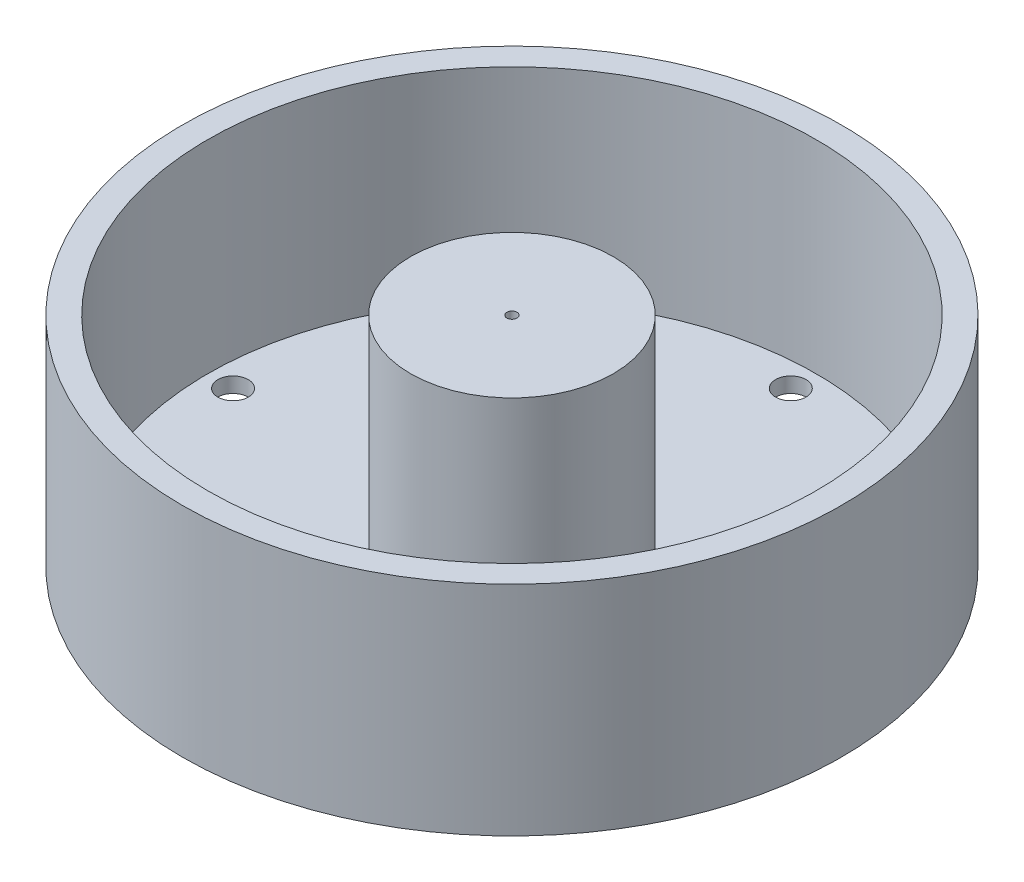
ISO-10303-21;
HEADER;
FILE_DESCRIPTION(('STEP AP214'),'2;1');
FILE_NAME('part.step','',(''),(''),'','','');
FILE_SCHEMA(('AUTOMOTIVE_DESIGN { 1 0 10303 214 1 1 1 1 }'));
ENDSEC;
DATA;
#1=APPLICATION_CONTEXT('core data for automotive mechanical design processes');
#2=APPLICATION_PROTOCOL_DEFINITION('international standard','automotive_design',2000,#1);
#3=PRODUCT_CONTEXT('',#1,'mechanical');
#4=PRODUCT('Part','Part','',(#3));
#5=PRODUCT_RELATED_PRODUCT_CATEGORY('part','',(#4));
#6=PRODUCT_DEFINITION_FORMATION('','',#4);
#7=PRODUCT_DEFINITION_CONTEXT('part definition',#1,'design');
#8=PRODUCT_DEFINITION('design','',#6,#7);
#9=PRODUCT_DEFINITION_SHAPE('','',#8);
#10=(LENGTH_UNIT() NAMED_UNIT(*) SI_UNIT(.MILLI.,.METRE.));
#11=(NAMED_UNIT(*) PLANE_ANGLE_UNIT() SI_UNIT($,.RADIAN.));
#12=(NAMED_UNIT(*) SI_UNIT($,.STERADIAN.) SOLID_ANGLE_UNIT());
#13=UNCERTAINTY_MEASURE_WITH_UNIT(LENGTH_MEASURE(1.E-05),#10,'distance_accuracy_value','');
#14=(GEOMETRIC_REPRESENTATION_CONTEXT(3) GLOBAL_UNCERTAINTY_ASSIGNED_CONTEXT((#13)) GLOBAL_UNIT_ASSIGNED_CONTEXT((#10,
#11,#12)) REPRESENTATION_CONTEXT('',''));
#15=CARTESIAN_POINT('',(0.,0.,0.));
#16=DIRECTION('',(0.,0.,1.));
#17=DIRECTION('',(1.,0.,0.));
#18=AXIS2_PLACEMENT_3D('',#15,#16,#17);
#19=CARTESIAN_POINT('',(0.,3.,0.));
#20=DIRECTION('',(0.,1.,0.));
#21=DIRECTION('',(0.,0.,1.));
#22=AXIS2_PLACEMENT_3D('',#19,#20,#21);
#23=PLANE('',#22);
#24=CARTESIAN_POINT('',(0.,3.,0.));
#25=DIRECTION('',(0.,1.,0.));
#26=DIRECTION('',(0.,0.,1.));
#27=AXIS2_PLACEMENT_3D('',#24,#25,#26);
#28=CIRCLE('',#27,20.);
#29=CARTESIAN_POINT('',(0.,3.,20.));
#30=VERTEX_POINT('',#29);
#31=EDGE_CURVE('E76',#30,#30,#28,.T.);
#32=ORIENTED_EDGE('',*,*,#31,.F.);
#33=EDGE_LOOP('',(#32));
#34=FACE_BOUND('',#33,.T.);
#35=CARTESIAN_POINT('',(0.,3.,-55.));
#36=DIRECTION('',(0.,1.,0.));
#37=DIRECTION('',(0.,0.,1.));
#38=AXIS2_PLACEMENT_3D('',#35,#36,#37);
#39=CIRCLE('',#38,3.);
#40=CARTESIAN_POINT('',(0.,3.,-52.));
#41=VERTEX_POINT('',#40);
#42=EDGE_CURVE('E43',#41,#41,#39,.T.);
#43=ORIENTED_EDGE('',*,*,#42,.F.);
#44=EDGE_LOOP('',(#43));
#45=FACE_BOUND('',#44,.T.);
#46=CARTESIAN_POINT('',(55.,3.,-5.76094420909117E-13));
#47=DIRECTION('',(0.,1.,0.));
#48=DIRECTION('',(-1.,0.,0.));
#49=AXIS2_PLACEMENT_3D('',#46,#47,#48);
#50=CIRCLE('',#49,3.);
#51=CARTESIAN_POINT('',(52.,3.,-5.44671088859529E-13));
#52=VERTEX_POINT('',#51);
#53=EDGE_CURVE('E49',#52,#52,#50,.T.);
#54=ORIENTED_EDGE('',*,*,#53,.F.);
#55=EDGE_LOOP('',(#54));
#56=FACE_BOUND('',#55,.T.);
#57=CARTESIAN_POINT('',(0.,3.,55.));
#58=DIRECTION('',(0.,1.,0.));
#59=DIRECTION('',(0.,0.,-1.));
#60=AXIS2_PLACEMENT_3D('',#57,#58,#59);
#61=CIRCLE('',#60,3.);
#62=CARTESIAN_POINT('',(0.,3.,52.));
#63=VERTEX_POINT('',#62);
#64=EDGE_CURVE('E57',#63,#63,#61,.T.);
#65=ORIENTED_EDGE('',*,*,#64,.F.);
#66=EDGE_LOOP('',(#65));
#67=FACE_BOUND('',#66,.T.);
#68=CARTESIAN_POINT('',(-55.,3.,1.92031473636372E-13));
#69=DIRECTION('',(0.,1.,0.));
#70=DIRECTION('',(1.,0.,0.));
#71=AXIS2_PLACEMENT_3D('',#68,#69,#70);
#72=CIRCLE('',#71,3.);
#73=CARTESIAN_POINT('',(-52.,3.,1.81557029619843E-13));
#74=VERTEX_POINT('',#73);
#75=EDGE_CURVE('E47',#74,#74,#72,.T.);
#76=ORIENTED_EDGE('',*,*,#75,.F.);
#77=EDGE_LOOP('',(#76));
#78=FACE_BOUND('',#77,.T.);
#79=CARTESIAN_POINT('',(0.,3.,0.));
#80=DIRECTION('',(0.,1.,0.));
#81=DIRECTION('',(0.,0.,1.));
#82=AXIS2_PLACEMENT_3D('',#79,#80,#81);
#83=CIRCLE('',#82,60.);
#84=CARTESIAN_POINT('',(0.,3.,60.));
#85=VERTEX_POINT('',#84);
#86=EDGE_CURVE('E70',#85,#85,#83,.T.);
#87=ORIENTED_EDGE('',*,*,#86,.T.);
#88=EDGE_LOOP('',(#87));
#89=FACE_BOUND('',#88,.T.);
#90=ADVANCED_FACE('F31',(#34,#45,#56,#67,#78,#89),#23,.T.);
#91=CARTESIAN_POINT('',(0.,3.,0.));
#92=DIRECTION('',(0.,-1.,0.));
#93=DIRECTION('',(0.,0.,-1.));
#94=AXIS2_PLACEMENT_3D('',#91,#92,#93);
#95=CYLINDRICAL_SURFACE('',#94,65.);
#96=CARTESIAN_POINT('',(0.,0.,0.));
#97=DIRECTION('',(0.,1.,0.));
#98=DIRECTION('',(0.,0.,1.));
#99=AXIS2_PLACEMENT_3D('',#96,#97,#98);
#100=CIRCLE('',#99,65.);
#101=CARTESIAN_POINT('',(0.,0.,65.));
#102=VERTEX_POINT('',#101);
#103=EDGE_CURVE('E10',#102,#102,#100,.T.);
#104=ORIENTED_EDGE('',*,*,#103,.T.);
#105=EDGE_LOOP('',(#104));
#106=FACE_BOUND('',#105,.T.);
#107=CARTESIAN_POINT('',(0.,43.,0.));
#108=DIRECTION('',(0.,1.,0.));
#109=DIRECTION('',(0.,0.,1.));
#110=AXIS2_PLACEMENT_3D('',#107,#108,#109);
#111=CIRCLE('',#110,65.);
#112=CARTESIAN_POINT('',(0.,43.,65.));
#113=VERTEX_POINT('',#112);
#114=EDGE_CURVE('E56',#113,#113,#111,.T.);
#115=ORIENTED_EDGE('',*,*,#114,.F.);
#116=EDGE_LOOP('',(#115));
#117=FACE_BOUND('',#116,.T.);
#118=ADVANCED_FACE('F33',(#106,#117),#95,.T.);
#119=CARTESIAN_POINT('',(0.,0.,0.));
#120=DIRECTION('',(0.,1.,0.));
#121=DIRECTION('',(0.,0.,1.));
#122=AXIS2_PLACEMENT_3D('',#119,#120,#121);
#123=PLANE('',#122);
#124=CARTESIAN_POINT('',(0.,0.,0.));
#125=DIRECTION('',(0.,-1.,0.));
#126=DIRECTION('',(0.,0.,-1.));
#127=AXIS2_PLACEMENT_3D('',#124,#125,#126);
#128=CIRCLE('',#127,10.);
#129=CARTESIAN_POINT('',(0.,0.,-10.));
#130=VERTEX_POINT('',#129);
#131=EDGE_CURVE('E82',#130,#130,#128,.T.);
#132=ORIENTED_EDGE('',*,*,#131,.F.);
#133=EDGE_LOOP('',(#132));
#134=FACE_BOUND('',#133,.T.);
#135=CARTESIAN_POINT('',(-55.,0.,1.92031473636372E-13));
#136=DIRECTION('',(0.,1.,0.));
#137=DIRECTION('',(1.,0.,0.));
#138=AXIS2_PLACEMENT_3D('',#135,#136,#137);
#139=CIRCLE('',#138,3.);
#140=CARTESIAN_POINT('',(-52.,0.,1.81557029619843E-13));
#141=VERTEX_POINT('',#140);
#142=EDGE_CURVE('E60',#141,#141,#139,.T.);
#143=ORIENTED_EDGE('',*,*,#142,.T.);
#144=EDGE_LOOP('',(#143));
#145=FACE_BOUND('',#144,.T.);
#146=CARTESIAN_POINT('',(0.,0.,55.));
#147=DIRECTION('',(0.,1.,0.));
#148=DIRECTION('',(0.,0.,-1.));
#149=AXIS2_PLACEMENT_3D('',#146,#147,#148);
#150=CIRCLE('',#149,3.);
#151=CARTESIAN_POINT('',(0.,0.,52.));
#152=VERTEX_POINT('',#151);
#153=EDGE_CURVE('E52',#152,#152,#150,.T.);
#154=ORIENTED_EDGE('',*,*,#153,.T.);
#155=EDGE_LOOP('',(#154));
#156=FACE_BOUND('',#155,.T.);
#157=CARTESIAN_POINT('',(55.,0.,-5.76094420909117E-13));
#158=DIRECTION('',(0.,1.,0.));
#159=DIRECTION('',(-1.,0.,0.));
#160=AXIS2_PLACEMENT_3D('',#157,#158,#159);
#161=CIRCLE('',#160,3.);
#162=CARTESIAN_POINT('',(52.,0.,-5.44671088859529E-13));
#163=VERTEX_POINT('',#162);
#164=EDGE_CURVE('E53',#163,#163,#161,.T.);
#165=ORIENTED_EDGE('',*,*,#164,.T.);
#166=EDGE_LOOP('',(#165));
#167=FACE_BOUND('',#166,.T.);
#168=CARTESIAN_POINT('',(0.,0.,-55.));
#169=DIRECTION('',(0.,1.,0.));
#170=DIRECTION('',(0.,0.,1.));
#171=AXIS2_PLACEMENT_3D('',#168,#169,#170);
#172=CIRCLE('',#171,3.);
#173=CARTESIAN_POINT('',(0.,0.,-52.));
#174=VERTEX_POINT('',#173);
#175=EDGE_CURVE('E39',#174,#174,#172,.T.);
#176=ORIENTED_EDGE('',*,*,#175,.T.);
#177=EDGE_LOOP('',(#176));
#178=FACE_BOUND('',#177,.T.);
#179=ORIENTED_EDGE('',*,*,#103,.F.);
#180=EDGE_LOOP('',(#179));
#181=FACE_BOUND('',#180,.T.);
#182=ADVANCED_FACE('F109',(#134,#145,#156,#167,#178,#181),#123,.F.);
#183=CARTESIAN_POINT('',(0.,0.,-55.));
#184=DIRECTION('',(0.,1.,0.));
#185=DIRECTION('',(0.,0.,1.));
#186=AXIS2_PLACEMENT_3D('',#183,#184,#185);
#187=CYLINDRICAL_SURFACE('',#186,3.);
#188=ORIENTED_EDGE('',*,*,#175,.F.);
#189=EDGE_LOOP('',(#188));
#190=FACE_BOUND('',#189,.T.);
#191=ORIENTED_EDGE('',*,*,#42,.T.);
#192=EDGE_LOOP('',(#191));
#193=FACE_BOUND('',#192,.T.);
#194=ADVANCED_FACE('F112',(#190,#193),#187,.F.);
#195=CARTESIAN_POINT('',(55.,0.,-5.76094420909117E-13));
#196=DIRECTION('',(0.,1.,0.));
#197=DIRECTION('',(-1.,0.,0.));
#198=AXIS2_PLACEMENT_3D('',#195,#196,#197);
#199=CYLINDRICAL_SURFACE('',#198,3.);
#200=ORIENTED_EDGE('',*,*,#164,.F.);
#201=EDGE_LOOP('',(#200));
#202=FACE_BOUND('',#201,.T.);
#203=ORIENTED_EDGE('',*,*,#53,.T.);
#204=EDGE_LOOP('',(#203));
#205=FACE_BOUND('',#204,.T.);
#206=ADVANCED_FACE('F124',(#202,#205),#199,.F.);
#207=CARTESIAN_POINT('',(0.,0.,55.));
#208=DIRECTION('',(0.,1.,0.));
#209=DIRECTION('',(0.,0.,-1.));
#210=AXIS2_PLACEMENT_3D('',#207,#208,#209);
#211=CYLINDRICAL_SURFACE('',#210,3.);
#212=ORIENTED_EDGE('',*,*,#153,.F.);
#213=EDGE_LOOP('',(#212));
#214=FACE_BOUND('',#213,.T.);
#215=ORIENTED_EDGE('',*,*,#64,.T.);
#216=EDGE_LOOP('',(#215));
#217=FACE_BOUND('',#216,.T.);
#218=ADVANCED_FACE('F159',(#214,#217),#211,.F.);
#219=CARTESIAN_POINT('',(-55.,0.,1.92031473636372E-13));
#220=DIRECTION('',(0.,1.,0.));
#221=DIRECTION('',(1.,0.,0.));
#222=AXIS2_PLACEMENT_3D('',#219,#220,#221);
#223=CYLINDRICAL_SURFACE('',#222,3.);
#224=ORIENTED_EDGE('',*,*,#142,.F.);
#225=EDGE_LOOP('',(#224));
#226=FACE_BOUND('',#225,.T.);
#227=ORIENTED_EDGE('',*,*,#75,.T.);
#228=EDGE_LOOP('',(#227));
#229=FACE_BOUND('',#228,.T.);
#230=ADVANCED_FACE('F152',(#226,#229),#223,.F.);
#231=CARTESIAN_POINT('',(0.,43.,0.));
#232=DIRECTION('',(0.,1.,0.));
#233=DIRECTION('',(0.,0.,1.));
#234=AXIS2_PLACEMENT_3D('',#231,#232,#233);
#235=PLANE('',#234);
#236=ORIENTED_EDGE('',*,*,#114,.T.);
#237=EDGE_LOOP('',(#236));
#238=FACE_BOUND('',#237,.T.);
#239=CARTESIAN_POINT('',(0.,43.,0.));
#240=DIRECTION('',(0.,1.,0.));
#241=DIRECTION('',(0.,0.,1.));
#242=AXIS2_PLACEMENT_3D('',#239,#240,#241);
#243=CIRCLE('',#242,60.);
#244=CARTESIAN_POINT('',(0.,43.,60.));
#245=VERTEX_POINT('',#244);
#246=EDGE_CURVE('E69',#245,#245,#243,.T.);
#247=ORIENTED_EDGE('',*,*,#246,.F.);
#248=EDGE_LOOP('',(#247));
#249=FACE_BOUND('',#248,.T.);
#250=ADVANCED_FACE('F143',(#238,#249),#235,.T.);
#251=CARTESIAN_POINT('',(0.,43.,0.));
#252=DIRECTION('',(0.,-1.,0.));
#253=DIRECTION('',(0.,0.,-1.));
#254=AXIS2_PLACEMENT_3D('',#251,#252,#253);
#255=CYLINDRICAL_SURFACE('',#254,60.);
#256=ORIENTED_EDGE('',*,*,#246,.T.);
#257=EDGE_LOOP('',(#256));
#258=FACE_BOUND('',#257,.T.);
#259=ORIENTED_EDGE('',*,*,#86,.F.);
#260=EDGE_LOOP('',(#259));
#261=FACE_BOUND('',#260,.T.);
#262=ADVANCED_FACE('F140',(#258,#261),#255,.F.);
#263=CARTESIAN_POINT('',(0.,43.,0.));
#264=DIRECTION('',(0.,-1.,0.));
#265=DIRECTION('',(0.,0.,-1.));
#266=AXIS2_PLACEMENT_3D('',#263,#264,#265);
#267=CYLINDRICAL_SURFACE('',#266,20.);
#268=CARTESIAN_POINT('',(0.,43.,0.));
#269=DIRECTION('',(0.,1.,0.));
#270=DIRECTION('',(0.,0.,1.));
#271=AXIS2_PLACEMENT_3D('',#268,#269,#270);
#272=CIRCLE('',#271,20.);
#273=CARTESIAN_POINT('',(0.,43.,20.));
#274=VERTEX_POINT('',#273);
#275=EDGE_CURVE('E73',#274,#274,#272,.T.);
#276=ORIENTED_EDGE('',*,*,#275,.F.);
#277=EDGE_LOOP('',(#276));
#278=FACE_BOUND('',#277,.T.);
#279=ORIENTED_EDGE('',*,*,#31,.T.);
#280=EDGE_LOOP('',(#279));
#281=FACE_BOUND('',#280,.T.);
#282=ADVANCED_FACE('F142',(#278,#281),#267,.T.);
#283=CARTESIAN_POINT('',(0.,43.,0.));
#284=DIRECTION('',(0.,1.,0.));
#285=DIRECTION('',(0.,0.,1.));
#286=AXIS2_PLACEMENT_3D('',#283,#284,#285);
#287=PLANE('',#286);
#288=CARTESIAN_POINT('',(0.,43.,0.));
#289=DIRECTION('',(0.,1.,0.));
#290=DIRECTION('',(0.,0.,1.));
#291=AXIS2_PLACEMENT_3D('',#288,#289,#290);
#292=CIRCLE('',#291,1.);
#293=CARTESIAN_POINT('',(0.,43.,1.));
#294=VERTEX_POINT('',#293);
#295=EDGE_CURVE('E87',#294,#294,#292,.T.);
#296=ORIENTED_EDGE('',*,*,#295,.F.);
#297=EDGE_LOOP('',(#296));
#298=FACE_BOUND('',#297,.T.);
#299=ORIENTED_EDGE('',*,*,#275,.T.);
#300=EDGE_LOOP('',(#299));
#301=FACE_BOUND('',#300,.T.);
#302=ADVANCED_FACE('F105',(#298,#301),#287,.T.);
#303=CARTESIAN_POINT('',(0.,30.,0.));
#304=DIRECTION('',(0.,-1.,0.));
#305=DIRECTION('',(0.,0.,-1.));
#306=AXIS2_PLACEMENT_3D('',#303,#304,#305);
#307=CYLINDRICAL_SURFACE('',#306,10.);
#308=CARTESIAN_POINT('',(0.,30.,0.));
#309=DIRECTION('',(0.,-1.,0.));
#310=DIRECTION('',(0.,0.,-1.));
#311=AXIS2_PLACEMENT_3D('',#308,#309,#310);
#312=CIRCLE('',#311,10.);
#313=CARTESIAN_POINT('',(0.,30.,-10.));
#314=VERTEX_POINT('',#313);
#315=EDGE_CURVE('E79',#314,#314,#312,.T.);
#316=ORIENTED_EDGE('',*,*,#315,.F.);
#317=EDGE_LOOP('',(#316));
#318=FACE_BOUND('',#317,.T.);
#319=ORIENTED_EDGE('',*,*,#131,.T.);
#320=EDGE_LOOP('',(#319));
#321=FACE_BOUND('',#320,.T.);
#322=ADVANCED_FACE('F99',(#318,#321),#307,.F.);
#323=CARTESIAN_POINT('',(0.,30.,0.));
#324=DIRECTION('',(0.,-1.,0.));
#325=DIRECTION('',(0.,0.,-1.));
#326=AXIS2_PLACEMENT_3D('',#323,#324,#325);
#327=PLANE('',#326);
#328=CARTESIAN_POINT('',(0.,30.,0.));
#329=DIRECTION('',(0.,-1.,0.));
#330=DIRECTION('',(0.,0.,-1.));
#331=AXIS2_PLACEMENT_3D('',#328,#329,#330);
#332=CIRCLE('',#331,1.);
#333=CARTESIAN_POINT('',(0.,30.,-1.));
#334=VERTEX_POINT('',#333);
#335=EDGE_CURVE('E35',#334,#334,#332,.T.);
#336=ORIENTED_EDGE('',*,*,#335,.F.);
#337=EDGE_LOOP('',(#336));
#338=FACE_BOUND('',#337,.T.);
#339=ORIENTED_EDGE('',*,*,#315,.T.);
#340=EDGE_LOOP('',(#339));
#341=FACE_BOUND('',#340,.T.);
#342=ADVANCED_FACE('F96',(#338,#341),#327,.T.);
#343=CARTESIAN_POINT('',(0.,0.,0.));
#344=DIRECTION('',(0.,1.,0.));
#345=DIRECTION('',(0.,0.,1.));
#346=AXIS2_PLACEMENT_3D('',#343,#344,#345);
#347=CYLINDRICAL_SURFACE('',#346,1.);
#348=ORIENTED_EDGE('',*,*,#335,.T.);
#349=EDGE_LOOP('',(#348));
#350=FACE_BOUND('',#349,.T.);
#351=ORIENTED_EDGE('',*,*,#295,.T.);
#352=EDGE_LOOP('',(#351));
#353=FACE_BOUND('',#352,.T.);
#354=ADVANCED_FACE('F94',(#350,#353),#347,.F.);
#355=CLOSED_SHELL('',(#90,#118,#182,#194,#206,#218,#230,#250,#262,#282,#302,#322,#342,#354));
#356=MANIFOLD_SOLID_BREP('B2',#355);
#357=ADVANCED_BREP_SHAPE_REPRESENTATION('',(#18,#356),#14);
#358=SHAPE_DEFINITION_REPRESENTATION(#9,#357);
ENDSEC;
END-ISO-10303-21;
